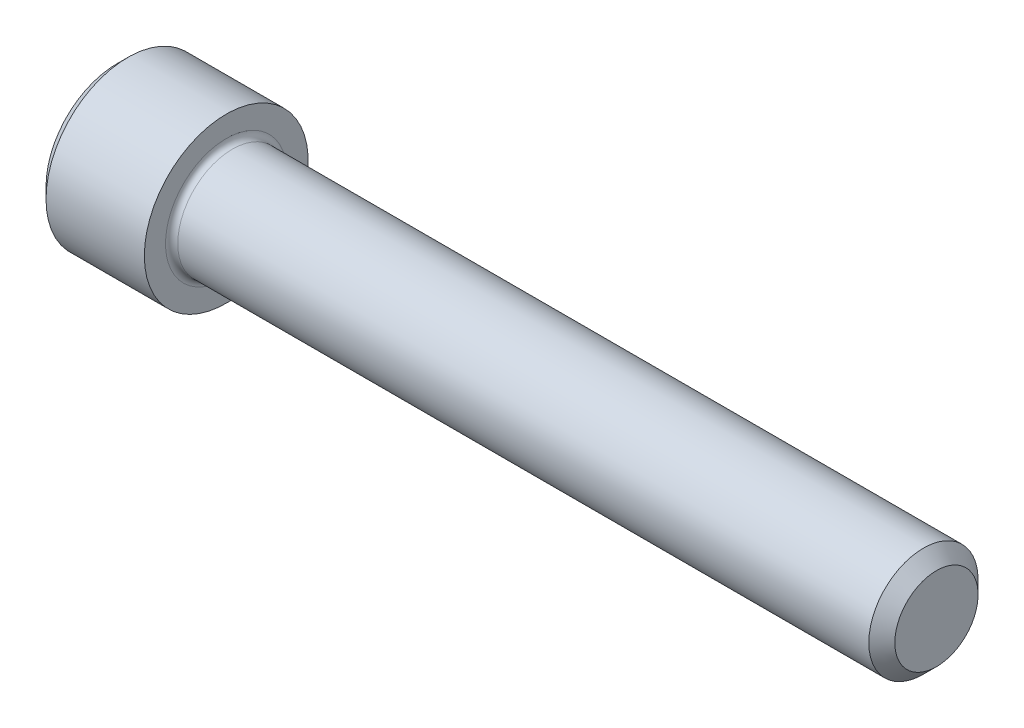
ISO-10303-21;
HEADER;
FILE_DESCRIPTION(('STEP AP214'),'2;1');
FILE_NAME('part.step','',(''),(''),'','','');
FILE_SCHEMA(('AUTOMOTIVE_DESIGN { 1 0 10303 214 1 1 1 1 }'));
ENDSEC;
DATA;
#1=APPLICATION_CONTEXT('core data for automotive mechanical design processes');
#2=APPLICATION_PROTOCOL_DEFINITION('international standard','automotive_design',2000,#1);
#3=PRODUCT_CONTEXT('',#1,'mechanical');
#4=PRODUCT('Part','Part','',(#3));
#5=PRODUCT_RELATED_PRODUCT_CATEGORY('part','',(#4));
#6=PRODUCT_DEFINITION_FORMATION('','',#4);
#7=PRODUCT_DEFINITION_CONTEXT('part definition',#1,'design');
#8=PRODUCT_DEFINITION('design','',#6,#7);
#9=PRODUCT_DEFINITION_SHAPE('','',#8);
#10=(LENGTH_UNIT() NAMED_UNIT(*) SI_UNIT(.MILLI.,.METRE.));
#11=(NAMED_UNIT(*) PLANE_ANGLE_UNIT() SI_UNIT($,.RADIAN.));
#12=(NAMED_UNIT(*) SI_UNIT($,.STERADIAN.) SOLID_ANGLE_UNIT());
#13=UNCERTAINTY_MEASURE_WITH_UNIT(LENGTH_MEASURE(1.E-05),#10,'distance_accuracy_value','');
#14=(GEOMETRIC_REPRESENTATION_CONTEXT(3) GLOBAL_UNCERTAINTY_ASSIGNED_CONTEXT((#13)) GLOBAL_UNIT_ASSIGNED_CONTEXT((#10,
#11,#12)) REPRESENTATION_CONTEXT('',''));
#15=CARTESIAN_POINT('',(0.,0.,0.));
#16=DIRECTION('',(0.,0.,1.));
#17=DIRECTION('',(1.,0.,0.));
#18=AXIS2_PLACEMENT_3D('',#15,#16,#17);
#19=CARTESIAN_POINT('',(0.,0.,0.));
#20=DIRECTION('',(-1.,0.,0.));
#21=DIRECTION('',(0.,0.,1.));
#22=AXIS2_PLACEMENT_3D('',#19,#20,#21);
#23=PLANE('',#22);
#24=DIRECTION('',(0.,-0.499999999999999,0.86602540378444));
#25=VECTOR('',#24,1.);
#26=CARTESIAN_POINT('',(0.,2.7496306570156,0.));
#27=LINE('',#26,#25);
#28=CARTESIAN_POINT('',(0.,2.7496306570156,0.));
#29=VERTEX_POINT('',#28);
#30=CARTESIAN_POINT('',(0.,1.3748153285078,2.38125));
#31=VERTEX_POINT('',#30);
#32=EDGE_CURVE('E267',#29,#31,#27,.T.);
#33=ORIENTED_EDGE('',*,*,#32,.T.);
#34=DIRECTION('',(0.,1.,0.));
#35=VECTOR('',#34,1.);
#36=CARTESIAN_POINT('',(0.,-1.37481532850779,2.38125));
#37=LINE('',#36,#35);
#38=CARTESIAN_POINT('',(0.,-1.37481532850779,2.38125));
#39=VERTEX_POINT('',#38);
#40=EDGE_CURVE('E127',#39,#31,#37,.T.);
#41=ORIENTED_EDGE('',*,*,#40,.F.);
#42=DIRECTION('',(0.,-0.500000000000001,-0.866025403784438));
#43=VECTOR('',#42,1.);
#44=CARTESIAN_POINT('',(0.,-1.37481532850779,2.38125));
#45=LINE('',#44,#43);
#46=CARTESIAN_POINT('',(0.,-2.74963065701559,0.));
#47=VERTEX_POINT('',#46);
#48=EDGE_CURVE('E270',#39,#47,#45,.T.);
#49=ORIENTED_EDGE('',*,*,#48,.T.);
#50=DIRECTION('',(0.,0.499999999999999,-0.866025403784439));
#51=VECTOR('',#50,1.);
#52=CARTESIAN_POINT('',(0.,-2.74963065701559,0.));
#53=LINE('',#52,#51);
#54=CARTESIAN_POINT('',(0.,-1.3748153285078,-2.38125));
#55=VERTEX_POINT('',#54);
#56=EDGE_CURVE('E273',#47,#55,#53,.T.);
#57=ORIENTED_EDGE('',*,*,#56,.T.);
#58=DIRECTION('',(0.,-1.,0.));
#59=VECTOR('',#58,1.);
#60=CARTESIAN_POINT('',(0.,1.3748153285078,-2.38125));
#61=LINE('',#60,#59);
#62=CARTESIAN_POINT('',(0.,1.3748153285078,-2.38125));
#63=VERTEX_POINT('',#62);
#64=EDGE_CURVE('E276',#63,#55,#61,.T.);
#65=ORIENTED_EDGE('',*,*,#64,.F.);
#66=DIRECTION('',(0.,-0.500000000000001,-0.866025403784438));
#67=VECTOR('',#66,1.);
#68=CARTESIAN_POINT('',(0.,2.7496306570156,0.));
#69=LINE('',#68,#67);
#70=EDGE_CURVE('E122',#29,#63,#69,.T.);
#71=ORIENTED_EDGE('',*,*,#70,.F.);
#72=EDGE_LOOP('',(#33,#41,#49,#57,#65,#71));
#73=FACE_BOUND('',#72,.T.);
#74=CARTESIAN_POINT('',(0.,0.,0.));
#75=DIRECTION('',(-1.,0.,0.));
#76=DIRECTION('',(0.,0.,1.));
#77=AXIS2_PLACEMENT_3D('',#74,#75,#76);
#78=CIRCLE('',#77,4.1275);
#79=CARTESIAN_POINT('',(0.,0.,4.1275));
#80=VERTEX_POINT('',#79);
#81=EDGE_CURVE('E151',#80,#80,#78,.T.);
#82=ORIENTED_EDGE('',*,*,#81,.T.);
#83=EDGE_LOOP('',(#82));
#84=FACE_BOUND('',#83,.T.);
#85=ADVANCED_FACE('F35',(#73,#84),#23,.T.);
#86=CARTESIAN_POINT('',(0.,0.,0.));
#87=DIRECTION('',(1.,0.,0.));
#88=DIRECTION('',(0.,0.,-1.));
#89=AXIS2_PLACEMENT_3D('',#86,#87,#88);
#90=CONICAL_SURFACE('',#89,4.1275,0.785398163397442);
#91=CARTESIAN_POINT('',(0.635000000000011,0.,0.));
#92=DIRECTION('',(-1.,0.,0.));
#93=DIRECTION('',(0.,0.,1.));
#94=AXIS2_PLACEMENT_3D('',#91,#92,#93);
#95=CIRCLE('',#94,4.7625);
#96=CARTESIAN_POINT('',(0.635000000000011,0.,4.7625));
#97=VERTEX_POINT('',#96);
#98=EDGE_CURVE('E148',#97,#97,#95,.T.);
#99=ORIENTED_EDGE('',*,*,#98,.T.);
#100=EDGE_LOOP('',(#99));
#101=FACE_BOUND('',#100,.T.);
#102=ORIENTED_EDGE('',*,*,#81,.F.);
#103=EDGE_LOOP('',(#102));
#104=FACE_BOUND('',#103,.T.);
#105=ADVANCED_FACE('F172',(#101,#104),#90,.T.);
#106=CARTESIAN_POINT('',(-31.75,0.,0.));
#107=DIRECTION('',(-1.,0.,0.));
#108=DIRECTION('',(0.,0.,1.));
#109=AXIS2_PLACEMENT_3D('',#106,#107,#108);
#110=CYLINDRICAL_SURFACE('',#109,4.7625);
#111=CARTESIAN_POINT('',(6.35000000000001,0.,0.));
#112=DIRECTION('',(-1.,0.,0.));
#113=DIRECTION('',(0.,0.,1.));
#114=AXIS2_PLACEMENT_3D('',#111,#112,#113);
#115=CIRCLE('',#114,4.7625);
#116=CARTESIAN_POINT('',(6.35000000000001,0.,4.7625));
#117=VERTEX_POINT('',#116);
#118=EDGE_CURVE('E145',#117,#117,#115,.T.);
#119=ORIENTED_EDGE('',*,*,#118,.T.);
#120=EDGE_LOOP('',(#119));
#121=FACE_BOUND('',#120,.T.);
#122=ORIENTED_EDGE('',*,*,#98,.F.);
#123=EDGE_LOOP('',(#122));
#124=FACE_BOUND('',#123,.T.);
#125=ADVANCED_FACE('F177',(#121,#124),#110,.T.);
#126=CARTESIAN_POINT('',(6.35,4.7625,0.));
#127=DIRECTION('',(1.,0.,0.));
#128=DIRECTION('',(0.,0.,-1.));
#129=AXIS2_PLACEMENT_3D('',#126,#127,#128);
#130=PLANE('',#129);
#131=CARTESIAN_POINT('',(6.35,0.,0.));
#132=DIRECTION('',(1.,0.,0.));
#133=DIRECTION('',(0.,0.,-1.));
#134=AXIS2_PLACEMENT_3D('',#131,#132,#133);
#135=CIRCLE('',#134,3.53059999999925);
#136=CARTESIAN_POINT('',(6.35,0.,-3.53059999999925));
#137=VERTEX_POINT('',#136);
#138=EDGE_CURVE('E43',#137,#137,#135,.F.);
#139=ORIENTED_EDGE('',*,*,#138,.T.);
#140=EDGE_LOOP('',(#139));
#141=FACE_BOUND('',#140,.T.);
#142=ORIENTED_EDGE('',*,*,#118,.F.);
#143=EDGE_LOOP('',(#142));
#144=FACE_BOUND('',#143,.T.);
#145=ADVANCED_FACE('F156',(#141,#144),#130,.T.);
#146=CARTESIAN_POINT('',(-31.75,0.,0.));
#147=DIRECTION('',(-1.,0.,0.));
#148=DIRECTION('',(0.,0.,1.));
#149=AXIS2_PLACEMENT_3D('',#146,#147,#148);
#150=CYLINDRICAL_SURFACE('',#149,3.17499999999925);
#151=CARTESIAN_POINT('',(6.7056,0.,0.));
#152=DIRECTION('',(1.,0.,0.));
#153=DIRECTION('',(0.,0.,-1.));
#154=AXIS2_PLACEMENT_3D('',#151,#152,#153);
#155=CIRCLE('',#154,3.17499999999925);
#156=CARTESIAN_POINT('',(6.7056,0.,-3.17499999999925));
#157=VERTEX_POINT('',#156);
#158=EDGE_CURVE('E11',#157,#157,#155,.T.);
#159=ORIENTED_EDGE('',*,*,#158,.T.);
#160=EDGE_LOOP('',(#159));
#161=FACE_BOUND('',#160,.T.);
#162=CARTESIAN_POINT('',(46.8693499999985,0.,0.));
#163=DIRECTION('',(-1.,0.,0.));
#164=DIRECTION('',(0.,0.,1.));
#165=AXIS2_PLACEMENT_3D('',#162,#163,#164);
#166=CIRCLE('',#165,3.17499999999849);
#167=CARTESIAN_POINT('',(46.8693499999985,0.,3.17499999999849));
#168=VERTEX_POINT('',#167);
#169=EDGE_CURVE('E142',#168,#168,#166,.T.);
#170=ORIENTED_EDGE('',*,*,#169,.T.);
#171=EDGE_LOOP('',(#170));
#172=FACE_BOUND('',#171,.T.);
#173=ADVANCED_FACE('F187',(#161,#172),#150,.T.);
#174=CARTESIAN_POINT('',(47.625,0.,0.));
#175=DIRECTION('',(-1.,0.,0.));
#176=DIRECTION('',(0.,0.,1.));
#177=AXIS2_PLACEMENT_3D('',#174,#175,#176);
#178=CONICAL_SURFACE('',#177,2.41935,0.785398163395468);
#179=ORIENTED_EDGE('',*,*,#169,.F.);
#180=EDGE_LOOP('',(#179));
#181=FACE_BOUND('',#180,.T.);
#182=CARTESIAN_POINT('',(47.625,0.,0.));
#183=DIRECTION('',(-1.,0.,0.));
#184=DIRECTION('',(0.,0.,1.));
#185=AXIS2_PLACEMENT_3D('',#182,#183,#184);
#186=CIRCLE('',#185,2.41935);
#187=CARTESIAN_POINT('',(47.625,0.,2.41935));
#188=VERTEX_POINT('',#187);
#189=EDGE_CURVE('E138',#188,#188,#186,.T.);
#190=ORIENTED_EDGE('',*,*,#189,.T.);
#191=EDGE_LOOP('',(#190));
#192=FACE_BOUND('',#191,.T.);
#193=ADVANCED_FACE('F167',(#181,#192),#178,.T.);
#194=CARTESIAN_POINT('',(47.625,2.41935,0.));
#195=DIRECTION('',(1.,0.,0.));
#196=DIRECTION('',(0.,0.,-1.));
#197=AXIS2_PLACEMENT_3D('',#194,#195,#196);
#198=PLANE('',#197);
#199=ORIENTED_EDGE('',*,*,#189,.F.);
#200=EDGE_LOOP('',(#199));
#201=FACE_BOUND('',#200,.T.);
#202=ADVANCED_FACE('F160',(#201),#198,.T.);
#203=CARTESIAN_POINT('',(6.7056,0.,0.));
#204=DIRECTION('',(1.,0.,0.));
#205=DIRECTION('',(0.,0.,-1.));
#206=AXIS2_PLACEMENT_3D('',#203,#204,#205);
#207=TOROIDAL_SURFACE('',#206,3.53059999999925,0.3556);
#208=ORIENTED_EDGE('',*,*,#158,.F.);
#209=EDGE_LOOP('',(#208));
#210=FACE_BOUND('',#209,.T.);
#211=ORIENTED_EDGE('',*,*,#138,.F.);
#212=EDGE_LOOP('',(#211));
#213=FACE_BOUND('',#212,.T.);
#214=ADVANCED_FACE('F37',(#210,#213),#207,.F.);
#215=CARTESIAN_POINT('',(3.048,2.7496306570156,0.));
#216=DIRECTION('',(0.,-0.86602540378444,-0.499999999999998));
#217=DIRECTION('',(0.,0.499999999999998,-0.86602540378444));
#218=AXIS2_PLACEMENT_3D('',#215,#216,#217);
#219=PLANE('',#218);
#220=ORIENTED_EDGE('',*,*,#32,.F.);
#221=DIRECTION('',(-1.,0.,0.));
#222=VECTOR('',#221,1.);
#223=CARTESIAN_POINT('',(3.048,2.7496306570156,0.));
#224=LINE('',#223,#222);
#225=CARTESIAN_POINT('',(3.048,2.7496306570156,0.));
#226=VERTEX_POINT('',#225);
#227=EDGE_CURVE('E266',#226,#29,#224,.T.);
#228=ORIENTED_EDGE('',*,*,#227,.F.);
#229=DIRECTION('',(0.,-0.499999999999999,0.86602540378444));
#230=VECTOR('',#229,1.);
#231=CARTESIAN_POINT('',(3.048,2.7496306570156,0.));
#232=LINE('',#231,#230);
#233=CARTESIAN_POINT('',(3.04800000000001,2.06222299276169,1.190625));
#234=VERTEX_POINT('',#233);
#235=EDGE_CURVE('E50',#226,#234,#232,.T.);
#236=ORIENTED_EDGE('',*,*,#235,.T.);
#237=CARTESIAN_POINT('',(3.048,1.3748153285078,2.38125));
#238=VERTEX_POINT('',#237);
#239=EDGE_CURVE('E108',#234,#238,#232,.T.);
#240=ORIENTED_EDGE('',*,*,#239,.T.);
#241=DIRECTION('',(-1.,0.,0.));
#242=VECTOR('',#241,1.);
#243=CARTESIAN_POINT('',(3.048,1.3748153285078,2.38125));
#244=LINE('',#243,#242);
#245=EDGE_CURVE('E120',#238,#31,#244,.T.);
#246=ORIENTED_EDGE('',*,*,#245,.T.);
#247=EDGE_LOOP('',(#220,#228,#236,#240,#246));
#248=FACE_BOUND('',#247,.T.);
#249=ADVANCED_FACE('F119',(#248),#219,.T.);
#250=CARTESIAN_POINT('',(3.048,-1.37481532850779,2.38125));
#251=DIRECTION('',(0.,0.,1.));
#252=DIRECTION('',(0.,-1.,0.));
#253=AXIS2_PLACEMENT_3D('',#250,#251,#252);
#254=PLANE('',#253);
#255=ORIENTED_EDGE('',*,*,#40,.T.);
#256=ORIENTED_EDGE('',*,*,#245,.F.);
#257=DIRECTION('',(0.,1.,0.));
#258=VECTOR('',#257,1.);
#259=CARTESIAN_POINT('',(3.048,-1.37481532850779,2.38125));
#260=LINE('',#259,#258);
#261=CARTESIAN_POINT('',(3.048,0.,2.38125));
#262=VERTEX_POINT('',#261);
#263=EDGE_CURVE('E106',#262,#238,#260,.T.);
#264=ORIENTED_EDGE('',*,*,#263,.F.);
#265=CARTESIAN_POINT('',(3.048,-1.37481532850779,2.38125));
#266=VERTEX_POINT('',#265);
#267=EDGE_CURVE('E116',#266,#262,#260,.T.);
#268=ORIENTED_EDGE('',*,*,#267,.F.);
#269=DIRECTION('',(-1.,0.,0.));
#270=VECTOR('',#269,1.);
#271=CARTESIAN_POINT('',(3.048,-1.37481532850779,2.38125));
#272=LINE('',#271,#270);
#273=EDGE_CURVE('E129',#266,#39,#272,.T.);
#274=ORIENTED_EDGE('',*,*,#273,.T.);
#275=EDGE_LOOP('',(#255,#256,#264,#268,#274));
#276=FACE_BOUND('',#275,.T.);
#277=ADVANCED_FACE('F124',(#276),#254,.F.);
#278=CARTESIAN_POINT('',(3.048,-1.37481532850779,2.38125));
#279=DIRECTION('',(0.,0.866025403784438,-0.500000000000001));
#280=DIRECTION('',(0.,0.500000000000001,0.866025403784438));
#281=AXIS2_PLACEMENT_3D('',#278,#279,#280);
#282=PLANE('',#281);
#283=ORIENTED_EDGE('',*,*,#48,.F.);
#284=ORIENTED_EDGE('',*,*,#273,.F.);
#285=DIRECTION('',(0.,-0.500000000000001,-0.866025403784438));
#286=VECTOR('',#285,1.);
#287=CARTESIAN_POINT('',(3.048,-1.37481532850779,2.38125));
#288=LINE('',#287,#286);
#289=CARTESIAN_POINT('',(3.048,-2.06222299276169,1.190625));
#290=VERTEX_POINT('',#289);
#291=EDGE_CURVE('E247',#266,#290,#288,.T.);
#292=ORIENTED_EDGE('',*,*,#291,.T.);
#293=CARTESIAN_POINT('',(3.048,-2.74963065701559,0.));
#294=VERTEX_POINT('',#293);
#295=EDGE_CURVE('E249',#290,#294,#288,.T.);
#296=ORIENTED_EDGE('',*,*,#295,.T.);
#297=DIRECTION('',(-1.,0.,0.));
#298=VECTOR('',#297,1.);
#299=CARTESIAN_POINT('',(3.048,-2.74963065701559,0.));
#300=LINE('',#299,#298);
#301=EDGE_CURVE('E134',#294,#47,#300,.T.);
#302=ORIENTED_EDGE('',*,*,#301,.T.);
#303=EDGE_LOOP('',(#283,#284,#292,#296,#302));
#304=FACE_BOUND('',#303,.T.);
#305=ADVANCED_FACE('F199',(#304),#282,.T.);
#306=CARTESIAN_POINT('',(3.048,-2.74963065701559,0.));
#307=DIRECTION('',(0.,0.866025403784439,0.499999999999999));
#308=DIRECTION('',(0.,-0.499999999999999,0.866025403784439));
#309=AXIS2_PLACEMENT_3D('',#306,#307,#308);
#310=PLANE('',#309);
#311=ORIENTED_EDGE('',*,*,#56,.F.);
#312=ORIENTED_EDGE('',*,*,#301,.F.);
#313=DIRECTION('',(0.,0.499999999999999,-0.866025403784439));
#314=VECTOR('',#313,1.);
#315=CARTESIAN_POINT('',(3.048,-2.74963065701559,0.));
#316=LINE('',#315,#314);
#317=CARTESIAN_POINT('',(3.048,-2.06222299276169,-1.190625));
#318=VERTEX_POINT('',#317);
#319=EDGE_CURVE('E252',#294,#318,#316,.T.);
#320=ORIENTED_EDGE('',*,*,#319,.T.);
#321=CARTESIAN_POINT('',(3.048,-1.3748153285078,-2.38125));
#322=VERTEX_POINT('',#321);
#323=EDGE_CURVE('E256',#318,#322,#316,.T.);
#324=ORIENTED_EDGE('',*,*,#323,.T.);
#325=DIRECTION('',(-1.,0.,0.));
#326=VECTOR('',#325,1.);
#327=CARTESIAN_POINT('',(3.048,-1.3748153285078,-2.38125));
#328=LINE('',#327,#326);
#329=EDGE_CURVE('E285',#322,#55,#328,.T.);
#330=ORIENTED_EDGE('',*,*,#329,.T.);
#331=EDGE_LOOP('',(#311,#312,#320,#324,#330));
#332=FACE_BOUND('',#331,.T.);
#333=ADVANCED_FACE('F202',(#332),#310,.T.);
#334=CARTESIAN_POINT('',(3.048,1.3748153285078,-2.38125));
#335=DIRECTION('',(0.,0.,-1.));
#336=DIRECTION('',(0.,1.,0.));
#337=AXIS2_PLACEMENT_3D('',#334,#335,#336);
#338=PLANE('',#337);
#339=ORIENTED_EDGE('',*,*,#64,.T.);
#340=ORIENTED_EDGE('',*,*,#329,.F.);
#341=DIRECTION('',(0.,-1.,0.));
#342=VECTOR('',#341,1.);
#343=CARTESIAN_POINT('',(3.048,1.3748153285078,-2.38125));
#344=LINE('',#343,#342);
#345=CARTESIAN_POINT('',(3.048,0.,-2.38125));
#346=VERTEX_POINT('',#345);
#347=EDGE_CURVE('E260',#346,#322,#344,.T.);
#348=ORIENTED_EDGE('',*,*,#347,.F.);
#349=CARTESIAN_POINT('',(3.048,1.3748153285078,-2.38125));
#350=VERTEX_POINT('',#349);
#351=EDGE_CURVE('E261',#350,#346,#344,.T.);
#352=ORIENTED_EDGE('',*,*,#351,.F.);
#353=DIRECTION('',(-1.,0.,0.));
#354=VECTOR('',#353,1.);
#355=CARTESIAN_POINT('',(3.048,1.3748153285078,-2.38125));
#356=LINE('',#355,#354);
#357=EDGE_CURVE('E282',#350,#63,#356,.T.);
#358=ORIENTED_EDGE('',*,*,#357,.T.);
#359=EDGE_LOOP('',(#339,#340,#348,#352,#358));
#360=FACE_BOUND('',#359,.T.);
#361=ADVANCED_FACE('F206',(#360),#338,.F.);
#362=CARTESIAN_POINT('',(3.048,2.7496306570156,0.));
#363=DIRECTION('',(0.,0.866025403784438,-0.500000000000001));
#364=DIRECTION('',(0.,0.500000000000001,0.866025403784438));
#365=AXIS2_PLACEMENT_3D('',#362,#363,#364);
#366=PLANE('',#365);
#367=ORIENTED_EDGE('',*,*,#70,.T.);
#368=ORIENTED_EDGE('',*,*,#357,.F.);
#369=DIRECTION('',(0.,-0.500000000000001,-0.866025403784438));
#370=VECTOR('',#369,1.);
#371=CARTESIAN_POINT('',(3.048,2.7496306570156,0.));
#372=LINE('',#371,#370);
#373=CARTESIAN_POINT('',(3.048,2.0622229927617,-1.19062500000001));
#374=VERTEX_POINT('',#373);
#375=EDGE_CURVE('E264',#374,#350,#372,.T.);
#376=ORIENTED_EDGE('',*,*,#375,.F.);
#377=EDGE_CURVE('E238',#226,#374,#372,.T.);
#378=ORIENTED_EDGE('',*,*,#377,.F.);
#379=ORIENTED_EDGE('',*,*,#227,.T.);
#380=EDGE_LOOP('',(#367,#368,#376,#378,#379));
#381=FACE_BOUND('',#380,.T.);
#382=ADVANCED_FACE('F210',(#381),#366,.F.);
#383=CARTESIAN_POINT('',(3.048,1.3748153285078,2.38125));
#384=DIRECTION('',(-1.,0.,0.));
#385=DIRECTION('',(0.,0.,1.));
#386=AXIS2_PLACEMENT_3D('',#383,#384,#385);
#387=PLANE('',#386);
#388=CARTESIAN_POINT('',(3.04800000000001,0.,0.));
#389=DIRECTION('',(-1.,0.,0.));
#390=DIRECTION('',(0.,0.,1.));
#391=AXIS2_PLACEMENT_3D('',#388,#389,#390);
#392=CIRCLE('',#391,2.38125);
#393=EDGE_CURVE('E128',#290,#262,#392,.T.);
#394=ORIENTED_EDGE('',*,*,#393,.F.);
#395=ORIENTED_EDGE('',*,*,#291,.F.);
#396=ORIENTED_EDGE('',*,*,#267,.T.);
#397=EDGE_LOOP('',(#394,#395,#396));
#398=FACE_BOUND('',#397,.T.);
#399=ADVANCED_FACE('F214',(#398),#387,.T.);
#400=EDGE_CURVE('E132',#318,#290,#392,.T.);
#401=ORIENTED_EDGE('',*,*,#400,.F.);
#402=ORIENTED_EDGE('',*,*,#319,.F.);
#403=ORIENTED_EDGE('',*,*,#295,.F.);
#404=EDGE_LOOP('',(#401,#402,#403));
#405=FACE_BOUND('',#404,.T.);
#406=ADVANCED_FACE('F217',(#405),#387,.T.);
#407=EDGE_CURVE('E291',#346,#318,#392,.T.);
#408=ORIENTED_EDGE('',*,*,#407,.F.);
#409=ORIENTED_EDGE('',*,*,#347,.T.);
#410=ORIENTED_EDGE('',*,*,#323,.F.);
#411=EDGE_LOOP('',(#408,#409,#410));
#412=FACE_BOUND('',#411,.T.);
#413=ADVANCED_FACE('F222',(#412),#387,.T.);
#414=EDGE_CURVE('E241',#374,#346,#392,.T.);
#415=ORIENTED_EDGE('',*,*,#414,.F.);
#416=ORIENTED_EDGE('',*,*,#375,.T.);
#417=ORIENTED_EDGE('',*,*,#351,.T.);
#418=EDGE_LOOP('',(#415,#416,#417));
#419=FACE_BOUND('',#418,.T.);
#420=ADVANCED_FACE('F229',(#419),#387,.T.);
#421=EDGE_CURVE('E139',#234,#374,#392,.T.);
#422=ORIENTED_EDGE('',*,*,#421,.F.);
#423=ORIENTED_EDGE('',*,*,#235,.F.);
#424=ORIENTED_EDGE('',*,*,#377,.T.);
#425=EDGE_LOOP('',(#422,#423,#424));
#426=FACE_BOUND('',#425,.T.);
#427=ADVANCED_FACE('F225',(#426),#387,.T.);
#428=EDGE_CURVE('E111',#262,#234,#392,.T.);
#429=ORIENTED_EDGE('',*,*,#428,.F.);
#430=ORIENTED_EDGE('',*,*,#263,.T.);
#431=ORIENTED_EDGE('',*,*,#239,.F.);
#432=EDGE_LOOP('',(#429,#430,#431));
#433=FACE_BOUND('',#432,.T.);
#434=ADVANCED_FACE('F107',(#433),#387,.T.);
#435=CARTESIAN_POINT('',(3.04800000000001,0.,0.));
#436=DIRECTION('',(-1.,0.,0.));
#437=DIRECTION('',(0.,0.,1.));
#438=AXIS2_PLACEMENT_3D('',#435,#436,#437);
#439=CONICAL_SURFACE('',#438,2.38125,1.04719755119659);
#440=CARTESIAN_POINT('',(4.42281532850782,0.,0.));
#441=VERTEX_POINT('',#440);
#442=VERTEX_LOOP('',#441);
#443=FACE_BOUND('',#442,.T.);
#444=ORIENTED_EDGE('',*,*,#428,.T.);
#445=ORIENTED_EDGE('',*,*,#421,.T.);
#446=ORIENTED_EDGE('',*,*,#414,.T.);
#447=ORIENTED_EDGE('',*,*,#407,.T.);
#448=ORIENTED_EDGE('',*,*,#400,.T.);
#449=ORIENTED_EDGE('',*,*,#393,.T.);
#450=EDGE_LOOP('',(#444,#445,#446,#447,#448,#449));
#451=FACE_BOUND('',#450,.T.);
#452=ADVANCED_FACE('F194',(#443,#451),#439,.F.);
#453=CLOSED_SHELL('',(#85,#105,#125,#145,#173,#193,#202,#214,#249,#277,#305,#333,#361,#382,#399,
#406,#413,#420,#427,#434,#452));
#454=MANIFOLD_SOLID_BREP('B2',#453);
#455=ADVANCED_BREP_SHAPE_REPRESENTATION('',(#18,#454),#14);
#456=SHAPE_DEFINITION_REPRESENTATION(#9,#455);
ENDSEC;
END-ISO-10303-21;
